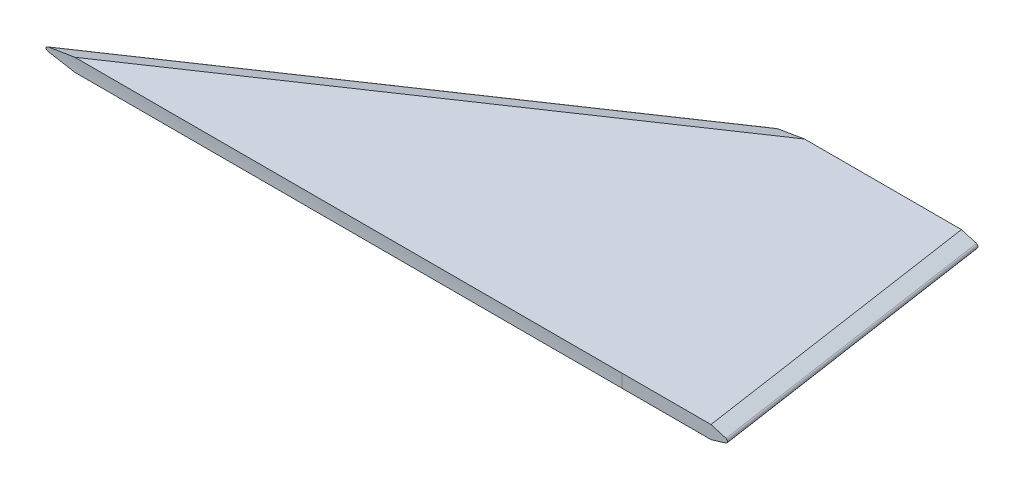
ISO-10303-21;
HEADER;
FILE_DESCRIPTION(('STEP AP214'),'2;1');
FILE_NAME('part.step','',(''),(''),'','','');
FILE_SCHEMA(('AUTOMOTIVE_DESIGN { 1 0 10303 214 1 1 1 1 }'));
ENDSEC;
DATA;
#1=APPLICATION_CONTEXT('core data for automotive mechanical design processes');
#2=APPLICATION_PROTOCOL_DEFINITION('international standard','automotive_design',2000,#1);
#3=PRODUCT_CONTEXT('',#1,'mechanical');
#4=PRODUCT('Part','Part','',(#3));
#5=PRODUCT_RELATED_PRODUCT_CATEGORY('part','',(#4));
#6=PRODUCT_DEFINITION_FORMATION('','',#4);
#7=PRODUCT_DEFINITION_CONTEXT('part definition',#1,'design');
#8=PRODUCT_DEFINITION('design','',#6,#7);
#9=PRODUCT_DEFINITION_SHAPE('','',#8);
#10=(LENGTH_UNIT() NAMED_UNIT(*) SI_UNIT(.MILLI.,.METRE.));
#11=(NAMED_UNIT(*) PLANE_ANGLE_UNIT() SI_UNIT($,.RADIAN.));
#12=(NAMED_UNIT(*) SI_UNIT($,.STERADIAN.) SOLID_ANGLE_UNIT());
#13=UNCERTAINTY_MEASURE_WITH_UNIT(LENGTH_MEASURE(1.E-05),#10,'distance_accuracy_value','');
#14=(GEOMETRIC_REPRESENTATION_CONTEXT(3) GLOBAL_UNCERTAINTY_ASSIGNED_CONTEXT((#13)) GLOBAL_UNIT_ASSIGNED_CONTEXT((#10,
#11,#12)) REPRESENTATION_CONTEXT('',''));
#15=CARTESIAN_POINT('',(0.,0.,0.));
#16=DIRECTION('',(0.,0.,1.));
#17=DIRECTION('',(1.,0.,0.));
#18=AXIS2_PLACEMENT_3D('',#15,#16,#17);
#19=CARTESIAN_POINT('',(256.472718824609,3.81000000000002,-167.786712852432));
#20=DIRECTION('',(-0.828848674075648,0.,0.559472855001063));
#21=DIRECTION('',(0.559472855001063,0.,0.828848674075648));
#22=AXIS2_PLACEMENT_3D('',#19,#20,#21);
#23=CYLINDRICAL_SURFACE('',#22,1.27);
#24=DIRECTION('',(-0.828848674075648,0.,0.559472855001063));
#25=VECTOR('',#24,1.);
#26=CARTESIAN_POINT('',(256.268549380375,2.59356061776916,-168.089186103148));
#27=LINE('',#26,#25);
#28=CARTESIAN_POINT('',(7.36926786745434,2.59356061776915,-0.082171081926985));
#29=VERTEX_POINT('',#28);
#30=CARTESIAN_POINT('',(261.247532931266,2.59356061776916,-171.45));
#31=VERTEX_POINT('',#30);
#32=EDGE_CURVE('E164',#29,#31,#27,.F.);
#33=ORIENTED_EDGE('',*,*,#32,.F.);
#34=CARTESIAN_POINT('',(7.36926786745434,2.59356061776915,-0.082171081926985));
#35=CARTESIAN_POINT('',(7.32481555748218,2.60105247519314,-0.0822858606765798));
#36=CARTESIAN_POINT('',(7.28050351834098,2.60935645850908,-0.0824121334348727));
#37=CARTESIAN_POINT('',(7.19221907540884,2.62766298071497,-0.0826869765083318));
#38=CARTESIAN_POINT('',(7.14824677263311,2.63766600589575,-0.0828355532057956));
#39=CARTESIAN_POINT('',(7.01641785373291,2.67046450514141,-0.083315591118084));
#40=CARTESIAN_POINT('',(6.92920835701318,2.69595742107114,-0.083679904643043));
#41=CARTESIAN_POINT('',(6.75615970668346,2.75534726983875,-0.0844915132099071));
#42=CARTESIAN_POINT('',(6.67036288358249,2.7893685981665,-0.0849400093671455));
#43=CARTESIAN_POINT('',(6.50325770146995,2.86670524622202,-0.0858969357718968));
#44=CARTESIAN_POINT('',(6.42193642807006,2.90999184839438,-0.0864051786894928));
#45=CARTESIAN_POINT('',(6.29117147913904,2.99180318646216,-0.0872824581264033));
#46=CARTESIAN_POINT('',(6.23988993762099,3.02737875136321,-0.087643668303467));
#47=CARTESIAN_POINT('',(6.14173878933823,3.10413630947137,-0.0883634106323481));
#48=CARTESIAN_POINT('',(6.09486346054026,3.1453108566906,-0.0887219456847963));
#49=CARTESIAN_POINT('',(6.00672842031376,3.23441080248686,-0.089418432962408));
#50=CARTESIAN_POINT('',(5.96554541952156,3.28241347021853,-0.0897560753998845));
#51=CARTESIAN_POINT('',(5.89232568286072,3.38498208062807,-0.0903712329940525));
#52=CARTESIAN_POINT('',(5.8602646252053,3.4395300082558,-0.090648907556664));
#53=CARTESIAN_POINT('',(5.81698875779773,3.53594089800351,-0.0910292042744726));
#54=CARTESIAN_POINT('',(5.80238623640946,3.57627971979756,-0.0911594096063122));
#55=CARTESIAN_POINT('',(5.78007248415143,3.65882775267984,-0.0913594603631127));
#56=CARTESIAN_POINT('',(5.77235513010777,3.70103526674713,-0.0914293594183223));
#57=CARTESIAN_POINT('',(5.76448098775591,3.78632125817831,-0.0915006859295081));
#58=CARTESIAN_POINT('',(5.76435233505627,3.82940238437996,-0.0915018585777141));
#59=CARTESIAN_POINT('',(5.77173914689923,3.91490477561645,-0.0914349332592873));
#60=CARTESIAN_POINT('',(5.7792570869517,3.95732582244154,-0.0913668128597047));
#61=CARTESIAN_POINT('',(5.8007648218033,4.03844906484777,-0.0911739104197521));
#62=CARTESIAN_POINT('',(5.81445403498288,4.0772327588845,-0.0910517644862625));
#63=CARTESIAN_POINT('',(5.8472456211238,4.15241183845086,-0.0907630883497291));
#64=CARTESIAN_POINT('',(5.86635007490584,4.1888062992776,-0.0905965410868212));
#65=CARTESIAN_POINT('',(5.9210564206284,4.2787320671742,-0.0901277246285435));
#66=CARTESIAN_POINT('',(5.95987583769603,4.33030459085903,-0.0898019891592725));
#67=CARTESIAN_POINT('',(6.04510756451635,4.42672871635435,-0.0891114672548615));
#68=CARTESIAN_POINT('',(6.09153977788683,4.47156209341589,-0.0887465793439407));
#69=CARTESIAN_POINT('',(6.21936713262594,4.58031353048415,-0.0877833085290176));
#70=CARTESIAN_POINT('',(6.30489922158018,4.6393341217463,-0.0871774179047657));
#71=CARTESIAN_POINT('',(6.48389367508518,4.74416326923723,-0.086012706621817));
#72=CARTESIAN_POINT('',(6.57738953486179,4.78991205617068,-0.0854541066855697));
#73=CARTESIAN_POINT('',(6.72932841133172,4.85346140426167,-0.0846371522156594));
#74=CARTESIAN_POINT('',(6.78625874908667,4.8749914328572,-0.0843502368824628));
#75=CARTESIAN_POINT('',(6.9013700531891,4.91447968490152,-0.0838105788198587));
#76=CARTESIAN_POINT('',(6.95955146527072,4.93243661115028,-0.0835578485118077));
#77=CARTESIAN_POINT('',(7.07598690136107,4.96479473443985,-0.0830935980973656));
#78=CARTESIAN_POINT('',(7.134227919553,4.97924322873905,-0.0828815389993823));
#79=CARTESIAN_POINT('',(7.25132569394543,5.00508190445957,-0.0824965409100621));
#80=CARTESIAN_POINT('',(7.31018177888352,5.01647511850228,-0.0823235631542894));
#81=CARTESIAN_POINT('',(7.36926786745434,5.02643938223089,-0.0821710819269981));
#82=B_SPLINE_CURVE_WITH_KNOTS('',3,(#34,#35,#36,#37,#38,#39,#40,#41,#42,#43,#44,#45,#46,#47,#48,
#49,#50,#51,#52,#53,#54,#55,#56,#57,#58,#59,#60,#61,#62,#63,#64,#65,#66,#67,#68,#69,#70,#71,#72,
#73,#74,#75,#76,#77,#78,#79,#80,#81),.UNSPECIFIED.,.F.,.F.,(4,2,2,2,2,2,2,2,2,2,2,2,2,2,2,2,2,2,
2,2,2,2,2,4),(0.,0.135222077459955,0.270482922890465,0.54269988386509,0.819145429613065,
1.09474623376921,1.28167081022489,1.46834918680069,1.6573387787103,1.84581964263168,
1.97400680581833,2.10207985457172,2.23062771283164,2.35921720045812,2.48212594658344,
2.60508198489586,2.79762630889445,2.99068231057401,3.30072124881151,3.61213550386732,
3.79462617169208,3.97718297160313,4.15712186588655,4.33688148906596),.UNSPECIFIED.);
#83=CARTESIAN_POINT('',(7.36926786745427,5.02643938223088,-0.0821710819269572));
#84=VERTEX_POINT('',#83);
#85=EDGE_CURVE('E11',#29,#84,#82,.T.);
#86=ORIENTED_EDGE('',*,*,#85,.T.);
#87=DIRECTION('',(0.828848674075648,0.,-0.559472855001063));
#88=VECTOR('',#87,1.);
#89=CARTESIAN_POINT('',(2.26854938037485,5.02643938223088,3.36081389685163));
#90=LINE('',#89,#88);
#91=CARTESIAN_POINT('',(261.247532931266,5.02643938223087,-171.45));
#92=VERTEX_POINT('',#91);
#93=EDGE_CURVE('E168',#92,#84,#90,.F.);
#94=ORIENTED_EDGE('',*,*,#93,.F.);
#95=CARTESIAN_POINT('',(261.89981089508,3.81000000000002,-171.45));
#96=DIRECTION('',(0.,0.,1.));
#97=DIRECTION('',(-1.,0.,0.));
#98=AXIS2_PLACEMENT_3D('',#95,#96,#97);
#99=ELLIPSE('',#98,2.26999395707516,1.27);
#100=EDGE_CURVE('E166',#31,#92,#99,.F.);
#101=ORIENTED_EDGE('',*,*,#100,.F.);
#102=EDGE_LOOP('',(#33,#86,#94,#101));
#103=FACE_BOUND('',#102,.T.);
#104=ADVANCED_FACE('F42',(#103),#23,.T.);
#105=CARTESIAN_POINT('',(0.,7.62,0.));
#106=DIRECTION('',(0.,0.,-1.));
#107=DIRECTION('',(-1.,0.,0.));
#108=AXIS2_PLACEMENT_3D('',#105,#106,#107);
#109=PLANE('',#108);
#110=DIRECTION('',(1.,0.,0.));
#111=VECTOR('',#110,1.);
#112=CARTESIAN_POINT('',(0.,7.62,0.));
#113=LINE('',#112,#111);
#114=CARTESIAN_POINT('',(341.63,7.62,0.));
#115=VERTEX_POINT('',#114);
#116=CARTESIAN_POINT('',(393.56138743613,7.62,0.));
#117=VERTEX_POINT('',#116);
#118=EDGE_CURVE('E137',#115,#117,#113,.T.);
#119=ORIENTED_EDGE('',*,*,#118,.F.);
#120=DIRECTION('',(0.,-1.,0.));
#121=VECTOR('',#120,1.);
#122=CARTESIAN_POINT('',(341.63,7.62,0.));
#123=LINE('',#122,#121);
#124=CARTESIAN_POINT('',(341.63,0.,0.));
#125=VERTEX_POINT('',#124);
#126=EDGE_CURVE('E120',#115,#125,#123,.T.);
#127=ORIENTED_EDGE('',*,*,#126,.T.);
#128=DIRECTION('',(1.,0.,0.));
#129=VECTOR('',#128,1.);
#130=CARTESIAN_POINT('',(0.,0.,0.));
#131=LINE('',#130,#129);
#132=CARTESIAN_POINT('',(393.56138743613,0.,0.));
#133=VERTEX_POINT('',#132);
#134=EDGE_CURVE('E127',#125,#133,#131,.T.);
#135=ORIENTED_EDGE('',*,*,#134,.T.);
#136=DIRECTION('',(0.958676668171441,0.284497883829925,0.));
#137=VECTOR('',#136,1.);
#138=CARTESIAN_POINT('',(406.4,3.81000000000009,0.));
#139=LINE('',#138,#137);
#140=CARTESIAN_POINT('',(402.300946473518,2.59356061776916,0.));
#141=VERTEX_POINT('',#140);
#142=EDGE_CURVE('E179',#133,#141,#139,.T.);
#143=ORIENTED_EDGE('',*,*,#142,.T.);
#144=CARTESIAN_POINT('',(401.932031656135,3.81000000000001,0.));
#145=DIRECTION('',(0.,0.,-1.));
#146=DIRECTION('',(-1.,0.,0.));
#147=AXIS2_PLACEMENT_3D('',#144,#145,#146);
#148=ELLIPSE('',#147,1.28386125638699,1.27);
#149=CARTESIAN_POINT('',(402.300946473518,5.02643938223085,0.));
#150=VERTEX_POINT('',#149);
#151=EDGE_CURVE('E187',#141,#150,#148,.F.);
#152=ORIENTED_EDGE('',*,*,#151,.T.);
#153=DIRECTION('',(0.958676668171442,-0.284497883829919,0.));
#154=VECTOR('',#153,1.);
#155=CARTESIAN_POINT('',(385.793185466036,9.92529968552441,0.));
#156=LINE('',#155,#154);
#157=EDGE_CURVE('E139',#150,#117,#156,.F.);
#158=ORIENTED_EDGE('',*,*,#157,.T.);
#159=EDGE_LOOP('',(#119,#127,#135,#143,#152,#158));
#160=FACE_BOUND('',#159,.T.);
#161=ADVANCED_FACE('F138',(#160),#109,.F.);
#162=CARTESIAN_POINT('',(381.,7.62,-171.45));
#163=DIRECTION('',(0.,0.,1.));
#164=DIRECTION('',(1.,0.,0.));
#165=AXIS2_PLACEMENT_3D('',#162,#163,#164);
#166=PLANE('',#165);
#167=DIRECTION('',(-0.958676668171442,0.284497883829919,0.));
#168=VECTOR('',#167,1.);
#169=CARTESIAN_POINT('',(383.737333700082,2.99766600787834,-171.45));
#170=LINE('',#169,#168);
#171=CARTESIAN_POINT('',(368.16138743613,7.62,-171.45));
#172=VERTEX_POINT('',#171);
#173=CARTESIAN_POINT('',(376.900946473518,5.02643938223085,-171.45));
#174=VERTEX_POINT('',#173);
#175=EDGE_CURVE('E171',#172,#174,#170,.F.);
#176=ORIENTED_EDGE('',*,*,#175,.T.);
#177=CARTESIAN_POINT('',(376.532031656135,3.81000000000001,-171.45));
#178=DIRECTION('',(0.,0.,1.));
#179=DIRECTION('',(-1.,0.,0.));
#180=AXIS2_PLACEMENT_3D('',#177,#178,#179);
#181=ELLIPSE('',#180,1.28386125638699,1.27);
#182=CARTESIAN_POINT('',(376.900946473518,2.59356061776917,-171.45));
#183=VERTEX_POINT('',#182);
#184=EDGE_CURVE('E56',#174,#183,#181,.F.);
#185=ORIENTED_EDGE('',*,*,#184,.T.);
#186=DIRECTION('',(-0.958676668171441,-0.284497883829925,0.));
#187=VECTOR('',#186,1.);
#188=CARTESIAN_POINT('',(404.344148234046,10.7376336776463,-171.45));
#189=LINE('',#188,#187);
#190=CARTESIAN_POINT('',(368.16138743613,0.,-171.45));
#191=VERTEX_POINT('',#190);
#192=EDGE_CURVE('E173',#183,#191,#189,.T.);
#193=ORIENTED_EDGE('',*,*,#192,.T.);
#194=DIRECTION('',(-1.,0.,0.));
#195=VECTOR('',#194,1.);
#196=CARTESIAN_POINT('',(381.,0.,-171.45));
#197=LINE('',#196,#195);
#198=CARTESIAN_POINT('',(276.699939570752,0.,-171.45));
#199=VERTEX_POINT('',#198);
#200=EDGE_CURVE('E142',#191,#199,#197,.T.);
#201=ORIENTED_EDGE('',*,*,#200,.T.);
#202=DIRECTION('',(-0.986205336802076,0.165526534619386,0.));
#203=VECTOR('',#202,1.);
#204=CARTESIAN_POINT('',(254.,3.81000000000009,-171.45));
#205=LINE('',#204,#203);
#206=EDGE_CURVE('E160',#199,#31,#205,.T.);
#207=ORIENTED_EDGE('',*,*,#206,.T.);
#208=ORIENTED_EDGE('',*,*,#100,.T.);
#209=DIRECTION('',(-0.986205336802077,-0.165526534619381,0.));
#210=VECTOR('',#209,1.);
#211=CARTESIAN_POINT('',(14.491937719426,-36.3894778199652,-171.45));
#212=LINE('',#211,#210);
#213=CARTESIAN_POINT('',(276.699939570752,7.62,-171.45));
#214=VERTEX_POINT('',#213);
#215=EDGE_CURVE('E157',#92,#214,#212,.F.);
#216=ORIENTED_EDGE('',*,*,#215,.T.);
#217=DIRECTION('',(-1.,0.,0.));
#218=VECTOR('',#217,1.);
#219=CARTESIAN_POINT('',(381.,7.62,-171.45));
#220=LINE('',#219,#218);
#221=EDGE_CURVE('E148',#172,#214,#220,.T.);
#222=ORIENTED_EDGE('',*,*,#221,.F.);
#223=EDGE_LOOP('',(#176,#185,#193,#201,#207,#208,#216,#222));
#224=FACE_BOUND('',#223,.T.);
#225=ADVANCED_FACE('F192',(#224),#166,.F.);
#226=CARTESIAN_POINT('',(0.,7.62,0.));
#227=DIRECTION('',(0.,-1.,0.));
#228=DIRECTION('',(0.,0.,-1.));
#229=AXIS2_PLACEMENT_3D('',#226,#227,#228);
#230=PLANE('',#229);
#231=CARTESIAN_POINT('',(22.6999395707519,7.62,0.));
#232=VERTEX_POINT('',#231);
#233=EDGE_CURVE('E131',#232,#115,#113,.T.);
#234=ORIENTED_EDGE('',*,*,#233,.T.);
#235=ORIENTED_EDGE('',*,*,#118,.T.);
#236=DIRECTION('',(-0.146548661089462,0.,-0.989203462353871));
#237=VECTOR('',#236,1.);
#238=CARTESIAN_POINT('',(385.109062336831,7.62,-57.0531944202712));
#239=LINE('',#238,#237);
#240=EDGE_CURVE('E182',#117,#172,#239,.T.);
#241=ORIENTED_EDGE('',*,*,#240,.T.);
#242=ORIENTED_EDGE('',*,*,#221,.T.);
#243=DIRECTION('',(-0.828848674075648,0.,0.559472855001063));
#244=VECTOR('',#243,1.);
#245=CARTESIAN_POINT('',(7.10530525851358,7.62,10.5263781607609));
#246=LINE('',#245,#244);
#247=EDGE_CURVE('E147',#214,#232,#246,.T.);
#248=ORIENTED_EDGE('',*,*,#247,.T.);
#249=EDGE_LOOP('',(#234,#235,#241,#242,#248));
#250=FACE_BOUND('',#249,.T.);
#251=ADVANCED_FACE('F145',(#250),#230,.F.);
#252=CARTESIAN_POINT('',(0.,0.,0.));
#253=DIRECTION('',(0.,-1.,0.));
#254=DIRECTION('',(0.,0.,-1.));
#255=AXIS2_PLACEMENT_3D('',#252,#253,#254);
#256=PLANE('',#255);
#257=ORIENTED_EDGE('',*,*,#200,.F.);
#258=DIRECTION('',(0.146548661089462,0.,0.989203462353871));
#259=VECTOR('',#258,1.);
#260=CARTESIAN_POINT('',(393.837116028106,0.,1.86116799583618));
#261=LINE('',#260,#259);
#262=EDGE_CURVE('E175',#191,#133,#261,.T.);
#263=ORIENTED_EDGE('',*,*,#262,.T.);
#264=ORIENTED_EDGE('',*,*,#134,.F.);
#265=CARTESIAN_POINT('',(22.6999395707517,0.,0.));
#266=VERTEX_POINT('',#265);
#267=EDGE_CURVE('E133',#266,#125,#131,.T.);
#268=ORIENTED_EDGE('',*,*,#267,.F.);
#269=DIRECTION('',(0.828848674075648,0.,-0.559472855001063));
#270=VECTOR('',#269,1.);
#271=CARTESIAN_POINT('',(261.105305258513,0.,-160.923621839239));
#272=LINE('',#271,#270);
#273=EDGE_CURVE('E149',#266,#199,#272,.T.);
#274=ORIENTED_EDGE('',*,*,#273,.T.);
#275=EDGE_LOOP('',(#257,#263,#264,#268,#274));
#276=FACE_BOUND('',#275,.T.);
#277=ADVANCED_FACE('F216',(#276),#256,.T.);
#278=CARTESIAN_POINT('',(7.10530525851358,7.62,10.5263781607609));
#279=DIRECTION('',(0.160763341916321,-0.957826285221152,0.238167913950105));
#280=DIRECTION('',(-0.828848674075648,0.,0.559472855001063));
#281=AXIS2_PLACEMENT_3D('',#278,#279,#280);
#282=PLANE('',#281);
#283=ORIENTED_EDGE('',*,*,#93,.T.);
#284=CARTESIAN_POINT('',(-117.457047807107,3.81,79.2835072697973));
#285=DIRECTION('',(0.160763341916321,-0.957826285221152,0.238167913950105));
#286=DIRECTION('',(-0.986992982698406,-0.156012613348539,0.0387932543139036));
#287=AXIS2_PLACEMENT_3D('',#284,#285,#286);
#288=ELLIPSE('',#287,493.738180942492,79.375);
#289=EDGE_CURVE('E63',#84,#232,#288,.T.);
#290=ORIENTED_EDGE('',*,*,#289,.T.);
#291=ORIENTED_EDGE('',*,*,#247,.F.);
#292=ORIENTED_EDGE('',*,*,#215,.F.);
#293=EDGE_LOOP('',(#283,#290,#291,#292));
#294=FACE_BOUND('',#293,.T.);
#295=ADVANCED_FACE('F206',(#294),#282,.F.);
#296=CARTESIAN_POINT('',(254.,3.81000000000009,-171.45));
#297=DIRECTION('',(-0.160763341916325,-0.95782628522115,-0.238167913950111));
#298=DIRECTION('',(0.828848674075648,0.,-0.559472855001063));
#299=AXIS2_PLACEMENT_3D('',#296,#297,#298);
#300=PLANE('',#299);
#301=ORIENTED_EDGE('',*,*,#273,.F.);
#302=CARTESIAN_POINT('',(-117.457047807106,3.81,79.2835072697973));
#303=DIRECTION('',(-0.160763341916325,-0.95782628522115,-0.238167913950111));
#304=DIRECTION('',(-0.986992982698406,0.156012613348542,0.0387932543139056));
#305=AXIS2_PLACEMENT_3D('',#302,#303,#304);
#306=ELLIPSE('',#305,493.738180942479,79.375);
#307=EDGE_CURVE('E134',#266,#29,#306,.F.);
#308=ORIENTED_EDGE('',*,*,#307,.T.);
#309=ORIENTED_EDGE('',*,*,#32,.T.);
#310=ORIENTED_EDGE('',*,*,#206,.F.);
#311=EDGE_LOOP('',(#301,#308,#309,#310));
#312=FACE_BOUND('',#311,.T.);
#313=ADVANCED_FACE('F212',(#312),#300,.T.);
#314=CARTESIAN_POINT('',(385.109062336831,7.62,-57.0531944202712));
#315=DIRECTION('',(-0.284245523302292,-0.957826285221152,0.042110447896636));
#316=DIRECTION('',(-0.146548661089462,0.,-0.989203462353871));
#317=AXIS2_PLACEMENT_3D('',#314,#315,#316);
#318=PLANE('',#317);
#319=ORIENTED_EDGE('',*,*,#157,.F.);
#320=DIRECTION('',(0.146548661089462,0.,0.989203462353871));
#321=VECTOR('',#320,1.);
#322=CARTESIAN_POINT('',(393.66092614657,5.02643938223086,-58.3201372068993));
#323=LINE('',#322,#321);
#324=EDGE_CURVE('E70',#150,#174,#323,.F.);
#325=ORIENTED_EDGE('',*,*,#324,.T.);
#326=ORIENTED_EDGE('',*,*,#175,.F.);
#327=ORIENTED_EDGE('',*,*,#240,.F.);
#328=EDGE_LOOP('',(#319,#325,#326,#327));
#329=FACE_BOUND('',#328,.T.);
#330=ADVANCED_FACE('F201',(#329),#318,.F.);
#331=CARTESIAN_POINT('',(406.4,3.81000000000009,0.));
#332=DIRECTION('',(0.284245523302298,-0.95782628522115,-0.0421104478966368));
#333=DIRECTION('',(0.146548661089462,0.,0.989203462353871));
#334=AXIS2_PLACEMENT_3D('',#331,#332,#333);
#335=PLANE('',#334);
#336=ORIENTED_EDGE('',*,*,#192,.F.);
#337=DIRECTION('',(-0.146548661089463,0.,-0.989203462353871));
#338=VECTOR('',#337,1.);
#339=CARTESIAN_POINT('',(402.388979837845,2.59356061776916,0.594225209208106));
#340=LINE('',#339,#338);
#341=EDGE_CURVE('E184',#183,#141,#340,.F.);
#342=ORIENTED_EDGE('',*,*,#341,.T.);
#343=ORIENTED_EDGE('',*,*,#142,.F.);
#344=ORIENTED_EDGE('',*,*,#262,.F.);
#345=EDGE_LOOP('',(#336,#342,#343,#344));
#346=FACE_BOUND('',#345,.T.);
#347=ADVANCED_FACE('F199',(#346),#335,.T.);
#348=CARTESIAN_POINT('',(402.027988023251,3.81000000000001,0.647705478036839));
#349=DIRECTION('',(-0.146548661089463,0.,-0.989203462353871));
#350=DIRECTION('',(-0.989203462353871,0.,0.146548661089463));
#351=AXIS2_PLACEMENT_3D('',#348,#349,#350);
#352=CYLINDRICAL_SURFACE('',#351,1.27);
#353=ORIENTED_EDGE('',*,*,#184,.F.);
#354=ORIENTED_EDGE('',*,*,#324,.F.);
#355=ORIENTED_EDGE('',*,*,#151,.F.);
#356=ORIENTED_EDGE('',*,*,#341,.F.);
#357=EDGE_LOOP('',(#353,#354,#355,#356));
#358=FACE_BOUND('',#357,.T.);
#359=ADVANCED_FACE('F44',(#358),#352,.T.);
#360=CARTESIAN_POINT('',(341.63,3.81,79.2835072697973));
#361=DIRECTION('',(1.,0.,0.));
#362=DIRECTION('',(0.,0.,-1.));
#363=AXIS2_PLACEMENT_3D('',#360,#361,#362);
#364=PLANE('',#363);
#365=CARTESIAN_POINT('',(341.63,3.81,79.2835072697973));
#366=DIRECTION('',(1.,0.,0.));
#367=DIRECTION('',(0.,0.,-1.));
#368=AXIS2_PLACEMENT_3D('',#365,#366,#367);
#369=CIRCLE('',#368,79.375);
#370=EDGE_CURVE('E123',#125,#115,#369,.T.);
#371=ORIENTED_EDGE('',*,*,#370,.F.);
#372=ORIENTED_EDGE('',*,*,#126,.F.);
#373=EDGE_LOOP('',(#371,#372));
#374=FACE_BOUND('',#373,.T.);
#375=ADVANCED_FACE('F122',(#374),#364,.F.);
#376=CARTESIAN_POINT('',(341.63,3.81,79.2835072697973));
#377=DIRECTION('',(-1.,0.,0.));
#378=DIRECTION('',(0.,0.,1.));
#379=AXIS2_PLACEMENT_3D('',#376,#377,#378);
#380=CYLINDRICAL_SURFACE('',#379,79.375);
#381=ORIENTED_EDGE('',*,*,#233,.F.);
#382=ORIENTED_EDGE('',*,*,#289,.F.);
#383=ORIENTED_EDGE('',*,*,#85,.F.);
#384=ORIENTED_EDGE('',*,*,#307,.F.);
#385=ORIENTED_EDGE('',*,*,#267,.T.);
#386=ORIENTED_EDGE('',*,*,#370,.T.);
#387=EDGE_LOOP('',(#381,#382,#383,#384,#385,#386));
#388=FACE_BOUND('',#387,.T.);
#389=ADVANCED_FACE('F129',(#388),#380,.F.);
#390=CLOSED_SHELL('',(#104,#161,#225,#251,#277,#295,#313,#330,#347,#359,#375,#389));
#391=MANIFOLD_SOLID_BREP('B2',#390);
#392=ADVANCED_BREP_SHAPE_REPRESENTATION('',(#18,#391),#14);
#393=SHAPE_DEFINITION_REPRESENTATION(#9,#392);
ENDSEC;
END-ISO-10303-21;
